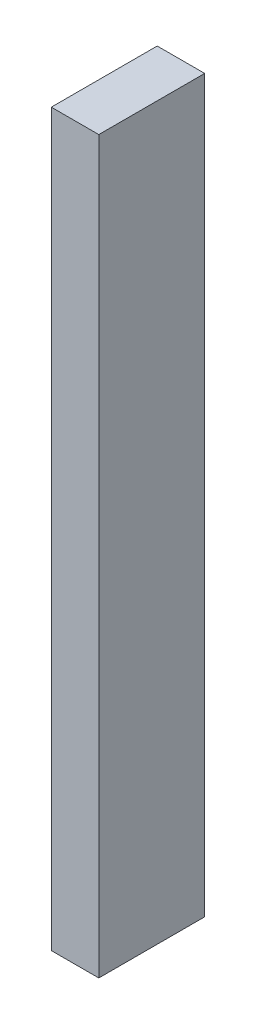
ISO-10303-21;
HEADER;
FILE_DESCRIPTION(('STEP AP214'),'2;1');
FILE_NAME('part.step','',(''),(''),'','','');
FILE_SCHEMA(('AUTOMOTIVE_DESIGN { 1 0 10303 214 1 1 1 1 }'));
ENDSEC;
DATA;
#1=APPLICATION_CONTEXT('core data for automotive mechanical design processes');
#2=APPLICATION_PROTOCOL_DEFINITION('international standard','automotive_design',2000,#1);
#3=PRODUCT_CONTEXT('',#1,'mechanical');
#4=PRODUCT('Part','Part','',(#3));
#5=PRODUCT_RELATED_PRODUCT_CATEGORY('part','',(#4));
#6=PRODUCT_DEFINITION_FORMATION('','',#4);
#7=PRODUCT_DEFINITION_CONTEXT('part definition',#1,'design');
#8=PRODUCT_DEFINITION('design','',#6,#7);
#9=PRODUCT_DEFINITION_SHAPE('','',#8);
#10=(LENGTH_UNIT() NAMED_UNIT(*) SI_UNIT(.MILLI.,.METRE.));
#11=(NAMED_UNIT(*) PLANE_ANGLE_UNIT() SI_UNIT($,.RADIAN.));
#12=(NAMED_UNIT(*) SI_UNIT($,.STERADIAN.) SOLID_ANGLE_UNIT());
#13=UNCERTAINTY_MEASURE_WITH_UNIT(LENGTH_MEASURE(1.E-05),#10,'distance_accuracy_value','');
#14=(GEOMETRIC_REPRESENTATION_CONTEXT(3) GLOBAL_UNCERTAINTY_ASSIGNED_CONTEXT((#13)) GLOBAL_UNIT_ASSIGNED_CONTEXT((#10,
#11,#12)) REPRESENTATION_CONTEXT('',''));
#15=CARTESIAN_POINT('',(0.,0.,0.));
#16=DIRECTION('',(0.,0.,1.));
#17=DIRECTION('',(1.,0.,0.));
#18=AXIS2_PLACEMENT_3D('',#15,#16,#17);
#19=CARTESIAN_POINT('',(6.49999999999998,100.,29.));
#20=DIRECTION('',(-1.,0.,0.));
#21=DIRECTION('',(0.,-1.,0.));
#22=AXIS2_PLACEMENT_3D('',#19,#20,#21);
#23=PLANE('',#22);
#24=DIRECTION('',(0.,1.,0.));
#25=VECTOR('',#24,1.);
#26=CARTESIAN_POINT('',(6.49999999999998,100.,0.));
#27=LINE('',#26,#25);
#28=CARTESIAN_POINT('',(6.50000000000001,-99.9999999999999,0.));
#29=VERTEX_POINT('',#28);
#30=CARTESIAN_POINT('',(6.49999999999998,100.,0.));
#31=VERTEX_POINT('',#30);
#32=EDGE_CURVE('E113',#29,#31,#27,.T.);
#33=ORIENTED_EDGE('',*,*,#32,.T.);
#34=DIRECTION('',(0.,0.,-1.));
#35=VECTOR('',#34,1.);
#36=CARTESIAN_POINT('',(6.49999999999998,100.,29.));
#37=LINE('',#36,#35);
#38=CARTESIAN_POINT('',(6.49999999999998,100.,29.));
#39=VERTEX_POINT('',#38);
#40=EDGE_CURVE('E11',#39,#31,#37,.T.);
#41=ORIENTED_EDGE('',*,*,#40,.F.);
#42=DIRECTION('',(0.,1.,0.));
#43=VECTOR('',#42,1.);
#44=CARTESIAN_POINT('',(6.49999999999998,100.,29.));
#45=LINE('',#44,#43);
#46=CARTESIAN_POINT('',(6.50000000000001,-99.9999999999999,29.));
#47=VERTEX_POINT('',#46);
#48=EDGE_CURVE('E97',#47,#39,#45,.T.);
#49=ORIENTED_EDGE('',*,*,#48,.F.);
#50=DIRECTION('',(0.,0.,-1.));
#51=VECTOR('',#50,1.);
#52=CARTESIAN_POINT('',(6.50000000000001,-99.9999999999999,29.));
#53=LINE('',#52,#51);
#54=EDGE_CURVE('E109',#47,#29,#53,.T.);
#55=ORIENTED_EDGE('',*,*,#54,.T.);
#56=EDGE_LOOP('',(#33,#41,#49,#55));
#57=FACE_BOUND('',#56,.T.);
#58=ADVANCED_FACE('F45',(#57),#23,.F.);
#59=CARTESIAN_POINT('',(-6.50000000000002,100.,29.));
#60=DIRECTION('',(0.,-1.,0.));
#61=DIRECTION('',(0.,0.,-1.));
#62=AXIS2_PLACEMENT_3D('',#59,#60,#61);
#63=PLANE('',#62);
#64=DIRECTION('',(-1.,0.,0.));
#65=VECTOR('',#64,1.);
#66=CARTESIAN_POINT('',(-6.50000000000002,100.,0.));
#67=LINE('',#66,#65);
#68=CARTESIAN_POINT('',(-6.50000000000002,100.,0.));
#69=VERTEX_POINT('',#68);
#70=EDGE_CURVE('E102',#31,#69,#67,.T.);
#71=ORIENTED_EDGE('',*,*,#70,.T.);
#72=DIRECTION('',(0.,0.,-1.));
#73=VECTOR('',#72,1.);
#74=CARTESIAN_POINT('',(-6.50000000000002,100.,29.));
#75=LINE('',#74,#73);
#76=CARTESIAN_POINT('',(-6.50000000000002,100.,29.));
#77=VERTEX_POINT('',#76);
#78=EDGE_CURVE('E54',#77,#69,#75,.T.);
#79=ORIENTED_EDGE('',*,*,#78,.F.);
#80=DIRECTION('',(-1.,0.,0.));
#81=VECTOR('',#80,1.);
#82=CARTESIAN_POINT('',(-6.50000000000002,100.,29.));
#83=LINE('',#82,#81);
#84=EDGE_CURVE('E92',#39,#77,#83,.T.);
#85=ORIENTED_EDGE('',*,*,#84,.F.);
#86=ORIENTED_EDGE('',*,*,#40,.T.);
#87=EDGE_LOOP('',(#71,#79,#85,#86));
#88=FACE_BOUND('',#87,.T.);
#89=ADVANCED_FACE('F101',(#88),#63,.F.);
#90=CARTESIAN_POINT('',(-6.50000000000002,100.,29.));
#91=DIRECTION('',(1.,0.,0.));
#92=DIRECTION('',(0.,1.,0.));
#93=AXIS2_PLACEMENT_3D('',#90,#91,#92);
#94=PLANE('',#93);
#95=DIRECTION('',(0.,-1.,0.));
#96=VECTOR('',#95,1.);
#97=CARTESIAN_POINT('',(-6.50000000000002,100.,0.));
#98=LINE('',#97,#96);
#99=CARTESIAN_POINT('',(-6.49999999999999,-99.9999999999999,0.));
#100=VERTEX_POINT('',#99);
#101=EDGE_CURVE('E79',#69,#100,#98,.T.);
#102=ORIENTED_EDGE('',*,*,#101,.T.);
#103=DIRECTION('',(0.,0.,-1.));
#104=VECTOR('',#103,1.);
#105=CARTESIAN_POINT('',(-6.49999999999999,-99.9999999999999,29.));
#106=LINE('',#105,#104);
#107=CARTESIAN_POINT('',(-6.49999999999999,-99.9999999999999,29.));
#108=VERTEX_POINT('',#107);
#109=EDGE_CURVE('E104',#108,#100,#106,.T.);
#110=ORIENTED_EDGE('',*,*,#109,.F.);
#111=DIRECTION('',(0.,-1.,0.));
#112=VECTOR('',#111,1.);
#113=CARTESIAN_POINT('',(-6.50000000000002,100.,29.));
#114=LINE('',#113,#112);
#115=EDGE_CURVE('E95',#77,#108,#114,.T.);
#116=ORIENTED_EDGE('',*,*,#115,.F.);
#117=ORIENTED_EDGE('',*,*,#78,.T.);
#118=EDGE_LOOP('',(#102,#110,#116,#117));
#119=FACE_BOUND('',#118,.T.);
#120=ADVANCED_FACE('F105',(#119),#94,.F.);
#121=CARTESIAN_POINT('',(-6.49999999999999,-99.9999999999999,29.));
#122=DIRECTION('',(0.,1.,0.));
#123=DIRECTION('',(0.,0.,1.));
#124=AXIS2_PLACEMENT_3D('',#121,#122,#123);
#125=PLANE('',#124);
#126=DIRECTION('',(1.,0.,0.));
#127=VECTOR('',#126,1.);
#128=CARTESIAN_POINT('',(-6.49999999999999,-99.9999999999999,0.));
#129=LINE('',#128,#127);
#130=EDGE_CURVE('E85',#100,#29,#129,.T.);
#131=ORIENTED_EDGE('',*,*,#130,.T.);
#132=ORIENTED_EDGE('',*,*,#54,.F.);
#133=DIRECTION('',(1.,0.,0.));
#134=VECTOR('',#133,1.);
#135=CARTESIAN_POINT('',(-6.49999999999999,-99.9999999999999,29.));
#136=LINE('',#135,#134);
#137=EDGE_CURVE('E62',#108,#47,#136,.T.);
#138=ORIENTED_EDGE('',*,*,#137,.F.);
#139=ORIENTED_EDGE('',*,*,#109,.T.);
#140=EDGE_LOOP('',(#131,#132,#138,#139));
#141=FACE_BOUND('',#140,.T.);
#142=ADVANCED_FACE('F126',(#141),#125,.F.);
#143=CARTESIAN_POINT('',(0.,0.,29.));
#144=DIRECTION('',(0.,0.,1.));
#145=DIRECTION('',(1.,0.,0.));
#146=AXIS2_PLACEMENT_3D('',#143,#144,#145);
#147=PLANE('',#146);
#148=ORIENTED_EDGE('',*,*,#48,.T.);
#149=ORIENTED_EDGE('',*,*,#84,.T.);
#150=ORIENTED_EDGE('',*,*,#115,.T.);
#151=ORIENTED_EDGE('',*,*,#137,.T.);
#152=EDGE_LOOP('',(#148,#149,#150,#151));
#153=FACE_BOUND('',#152,.T.);
#154=ADVANCED_FACE('F93',(#153),#147,.T.);
#155=CARTESIAN_POINT('',(0.,0.,0.));
#156=DIRECTION('',(0.,0.,1.));
#157=DIRECTION('',(1.,0.,0.));
#158=AXIS2_PLACEMENT_3D('',#155,#156,#157);
#159=PLANE('',#158);
#160=ORIENTED_EDGE('',*,*,#32,.F.);
#161=ORIENTED_EDGE('',*,*,#130,.F.);
#162=ORIENTED_EDGE('',*,*,#101,.F.);
#163=ORIENTED_EDGE('',*,*,#70,.F.);
#164=EDGE_LOOP('',(#160,#161,#162,#163));
#165=FACE_BOUND('',#164,.T.);
#166=ADVANCED_FACE('F129',(#165),#159,.F.);
#167=CLOSED_SHELL('',(#58,#89,#120,#142,#154,#166));
#168=MANIFOLD_SOLID_BREP('B2',#167);
#169=ADVANCED_BREP_SHAPE_REPRESENTATION('',(#18,#168),#14);
#170=SHAPE_DEFINITION_REPRESENTATION(#9,#169);
ENDSEC;
END-ISO-10303-21;
